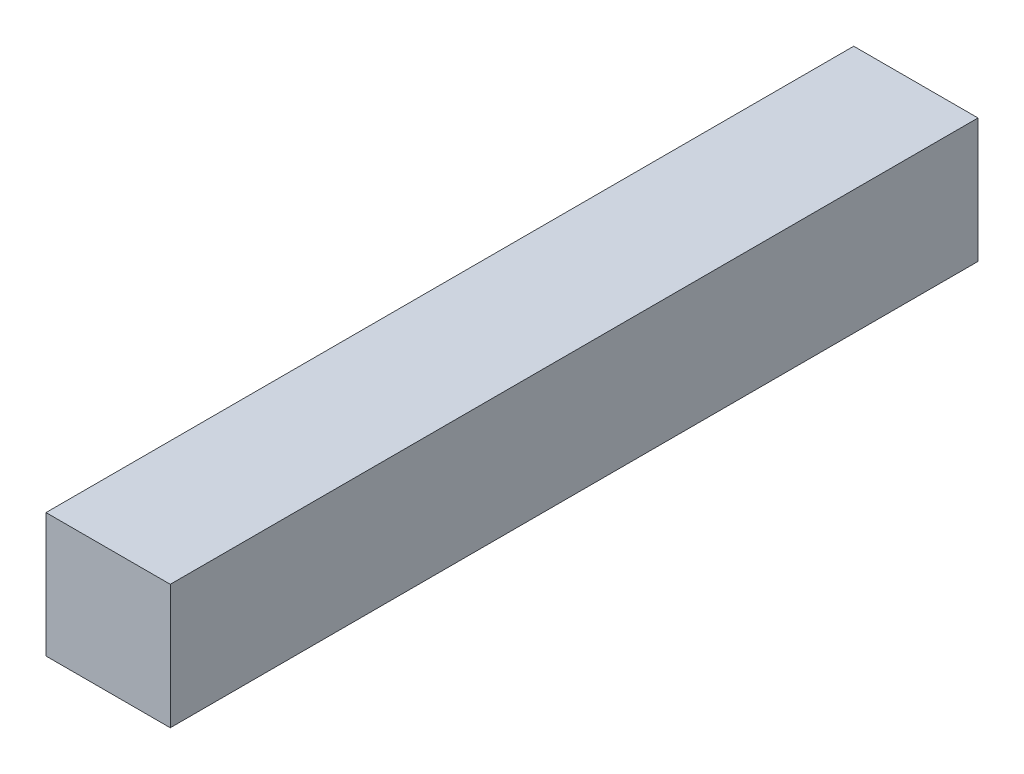
ISO-10303-21;
HEADER;
FILE_DESCRIPTION(('STEP AP214'),'2;1');
FILE_NAME('part.step','',(''),(''),'','','');
FILE_SCHEMA(('AUTOMOTIVE_DESIGN { 1 0 10303 214 1 1 1 1 }'));
ENDSEC;
DATA;
#1=APPLICATION_CONTEXT('core data for automotive mechanical design processes');
#2=APPLICATION_PROTOCOL_DEFINITION('international standard','automotive_design',2000,#1);
#3=PRODUCT_CONTEXT('',#1,'mechanical');
#4=PRODUCT('Part','Part','',(#3));
#5=PRODUCT_RELATED_PRODUCT_CATEGORY('part','',(#4));
#6=PRODUCT_DEFINITION_FORMATION('','',#4);
#7=PRODUCT_DEFINITION_CONTEXT('part definition',#1,'design');
#8=PRODUCT_DEFINITION('design','',#6,#7);
#9=PRODUCT_DEFINITION_SHAPE('','',#8);
#10=(LENGTH_UNIT() NAMED_UNIT(*) SI_UNIT(.MILLI.,.METRE.));
#11=(NAMED_UNIT(*) PLANE_ANGLE_UNIT() SI_UNIT($,.RADIAN.));
#12=(NAMED_UNIT(*) SI_UNIT($,.STERADIAN.) SOLID_ANGLE_UNIT());
#13=UNCERTAINTY_MEASURE_WITH_UNIT(LENGTH_MEASURE(1.E-05),#10,'distance_accuracy_value','');
#14=(GEOMETRIC_REPRESENTATION_CONTEXT(3) GLOBAL_UNCERTAINTY_ASSIGNED_CONTEXT((#13)) GLOBAL_UNIT_ASSIGNED_CONTEXT((#10,
#11,#12)) REPRESENTATION_CONTEXT('',''));
#15=CARTESIAN_POINT('',(0.,0.,0.));
#16=DIRECTION('',(0.,0.,1.));
#17=DIRECTION('',(1.,0.,0.));
#18=AXIS2_PLACEMENT_3D('',#15,#16,#17);
#19=CARTESIAN_POINT('',(7.,-7.,91.));
#20=DIRECTION('',(-1.,0.,0.));
#21=DIRECTION('',(0.,0.,1.));
#22=AXIS2_PLACEMENT_3D('',#19,#20,#21);
#23=PLANE('',#22);
#24=DIRECTION('',(0.,1.,0.));
#25=VECTOR('',#24,1.);
#26=CARTESIAN_POINT('',(7.,-7.,0.));
#27=LINE('',#26,#25);
#28=CARTESIAN_POINT('',(7.,-7.,0.));
#29=VERTEX_POINT('',#28);
#30=CARTESIAN_POINT('',(7.,7.,0.));
#31=VERTEX_POINT('',#30);
#32=EDGE_CURVE('E98',#29,#31,#27,.T.);
#33=ORIENTED_EDGE('',*,*,#32,.T.);
#34=DIRECTION('',(0.,0.,-1.));
#35=VECTOR('',#34,1.);
#36=CARTESIAN_POINT('',(7.,7.,91.));
#37=LINE('',#36,#35);
#38=CARTESIAN_POINT('',(7.,7.,91.));
#39=VERTEX_POINT('',#38);
#40=EDGE_CURVE('E11',#39,#31,#37,.T.);
#41=ORIENTED_EDGE('',*,*,#40,.F.);
#42=DIRECTION('',(0.,1.,0.));
#43=VECTOR('',#42,1.);
#44=CARTESIAN_POINT('',(7.,-7.,91.));
#45=LINE('',#44,#43);
#46=CARTESIAN_POINT('',(7.,-7.,91.));
#47=VERTEX_POINT('',#46);
#48=EDGE_CURVE('E86',#47,#39,#45,.T.);
#49=ORIENTED_EDGE('',*,*,#48,.F.);
#50=DIRECTION('',(0.,0.,-1.));
#51=VECTOR('',#50,1.);
#52=CARTESIAN_POINT('',(7.,-7.,91.));
#53=LINE('',#52,#51);
#54=EDGE_CURVE('E94',#47,#29,#53,.T.);
#55=ORIENTED_EDGE('',*,*,#54,.T.);
#56=EDGE_LOOP('',(#33,#41,#49,#55));
#57=FACE_BOUND('',#56,.T.);
#58=ADVANCED_FACE('F35',(#57),#23,.F.);
#59=CARTESIAN_POINT('',(-7.,7.,91.));
#60=DIRECTION('',(0.,-1.,0.));
#61=DIRECTION('',(0.,0.,-1.));
#62=AXIS2_PLACEMENT_3D('',#59,#60,#61);
#63=PLANE('',#62);
#64=DIRECTION('',(-1.,0.,0.));
#65=VECTOR('',#64,1.);
#66=CARTESIAN_POINT('',(-7.,7.,0.));
#67=LINE('',#66,#65);
#68=CARTESIAN_POINT('',(-7.,7.,0.));
#69=VERTEX_POINT('',#68);
#70=EDGE_CURVE('E90',#31,#69,#67,.T.);
#71=ORIENTED_EDGE('',*,*,#70,.T.);
#72=DIRECTION('',(0.,0.,-1.));
#73=VECTOR('',#72,1.);
#74=CARTESIAN_POINT('',(-7.,7.,91.));
#75=LINE('',#74,#73);
#76=CARTESIAN_POINT('',(-7.,7.,91.));
#77=VERTEX_POINT('',#76);
#78=EDGE_CURVE('E43',#77,#69,#75,.T.);
#79=ORIENTED_EDGE('',*,*,#78,.F.);
#80=DIRECTION('',(-1.,0.,0.));
#81=VECTOR('',#80,1.);
#82=CARTESIAN_POINT('',(-7.,7.,91.));
#83=LINE('',#82,#81);
#84=EDGE_CURVE('E81',#39,#77,#83,.T.);
#85=ORIENTED_EDGE('',*,*,#84,.F.);
#86=ORIENTED_EDGE('',*,*,#40,.T.);
#87=EDGE_LOOP('',(#71,#79,#85,#86));
#88=FACE_BOUND('',#87,.T.);
#89=ADVANCED_FACE('F89',(#88),#63,.F.);
#90=CARTESIAN_POINT('',(-7.,-7.,91.));
#91=DIRECTION('',(1.,0.,0.));
#92=DIRECTION('',(0.,0.,-1.));
#93=AXIS2_PLACEMENT_3D('',#90,#91,#92);
#94=PLANE('',#93);
#95=DIRECTION('',(0.,-1.,0.));
#96=VECTOR('',#95,1.);
#97=CARTESIAN_POINT('',(-7.,-7.,0.));
#98=LINE('',#97,#96);
#99=CARTESIAN_POINT('',(-7.,-7.,0.));
#100=VERTEX_POINT('',#99);
#101=EDGE_CURVE('E68',#69,#100,#98,.T.);
#102=ORIENTED_EDGE('',*,*,#101,.T.);
#103=DIRECTION('',(0.,0.,-1.));
#104=VECTOR('',#103,1.);
#105=CARTESIAN_POINT('',(-7.,-7.,91.));
#106=LINE('',#105,#104);
#107=CARTESIAN_POINT('',(-7.,-7.,91.));
#108=VERTEX_POINT('',#107);
#109=EDGE_CURVE('E91',#108,#100,#106,.T.);
#110=ORIENTED_EDGE('',*,*,#109,.F.);
#111=DIRECTION('',(0.,-1.,0.));
#112=VECTOR('',#111,1.);
#113=CARTESIAN_POINT('',(-7.,-7.,91.));
#114=LINE('',#113,#112);
#115=EDGE_CURVE('E84',#77,#108,#114,.T.);
#116=ORIENTED_EDGE('',*,*,#115,.F.);
#117=ORIENTED_EDGE('',*,*,#78,.T.);
#118=EDGE_LOOP('',(#102,#110,#116,#117));
#119=FACE_BOUND('',#118,.T.);
#120=ADVANCED_FACE('F92',(#119),#94,.F.);
#121=CARTESIAN_POINT('',(-7.,-7.,91.));
#122=DIRECTION('',(0.,1.,0.));
#123=DIRECTION('',(0.,0.,1.));
#124=AXIS2_PLACEMENT_3D('',#121,#122,#123);
#125=PLANE('',#124);
#126=DIRECTION('',(1.,0.,0.));
#127=VECTOR('',#126,1.);
#128=CARTESIAN_POINT('',(-7.,-7.,0.));
#129=LINE('',#128,#127);
#130=EDGE_CURVE('E74',#100,#29,#129,.T.);
#131=ORIENTED_EDGE('',*,*,#130,.T.);
#132=ORIENTED_EDGE('',*,*,#54,.F.);
#133=DIRECTION('',(1.,0.,0.));
#134=VECTOR('',#133,1.);
#135=CARTESIAN_POINT('',(-7.,-7.,91.));
#136=LINE('',#135,#134);
#137=EDGE_CURVE('E51',#108,#47,#136,.T.);
#138=ORIENTED_EDGE('',*,*,#137,.F.);
#139=ORIENTED_EDGE('',*,*,#109,.T.);
#140=EDGE_LOOP('',(#131,#132,#138,#139));
#141=FACE_BOUND('',#140,.T.);
#142=ADVANCED_FACE('F105',(#141),#125,.F.);
#143=CARTESIAN_POINT('',(0.,0.,91.));
#144=DIRECTION('',(0.,0.,-1.));
#145=DIRECTION('',(-1.,0.,0.));
#146=AXIS2_PLACEMENT_3D('',#143,#144,#145);
#147=PLANE('',#146);
#148=ORIENTED_EDGE('',*,*,#48,.T.);
#149=ORIENTED_EDGE('',*,*,#84,.T.);
#150=ORIENTED_EDGE('',*,*,#115,.T.);
#151=ORIENTED_EDGE('',*,*,#137,.T.);
#152=EDGE_LOOP('',(#148,#149,#150,#151));
#153=FACE_BOUND('',#152,.T.);
#154=ADVANCED_FACE('F82',(#153),#147,.F.);
#155=CARTESIAN_POINT('',(0.,0.,0.));
#156=DIRECTION('',(0.,0.,-1.));
#157=DIRECTION('',(-1.,0.,0.));
#158=AXIS2_PLACEMENT_3D('',#155,#156,#157);
#159=PLANE('',#158);
#160=ORIENTED_EDGE('',*,*,#32,.F.);
#161=ORIENTED_EDGE('',*,*,#130,.F.);
#162=ORIENTED_EDGE('',*,*,#101,.F.);
#163=ORIENTED_EDGE('',*,*,#70,.F.);
#164=EDGE_LOOP('',(#160,#161,#162,#163));
#165=FACE_BOUND('',#164,.T.);
#166=ADVANCED_FACE('F108',(#165),#159,.T.);
#167=CLOSED_SHELL('',(#58,#89,#120,#142,#154,#166));
#168=MANIFOLD_SOLID_BREP('B2',#167);
#169=ADVANCED_BREP_SHAPE_REPRESENTATION('',(#18,#168),#14);
#170=SHAPE_DEFINITION_REPRESENTATION(#9,#169);
ENDSEC;
END-ISO-10303-21;
